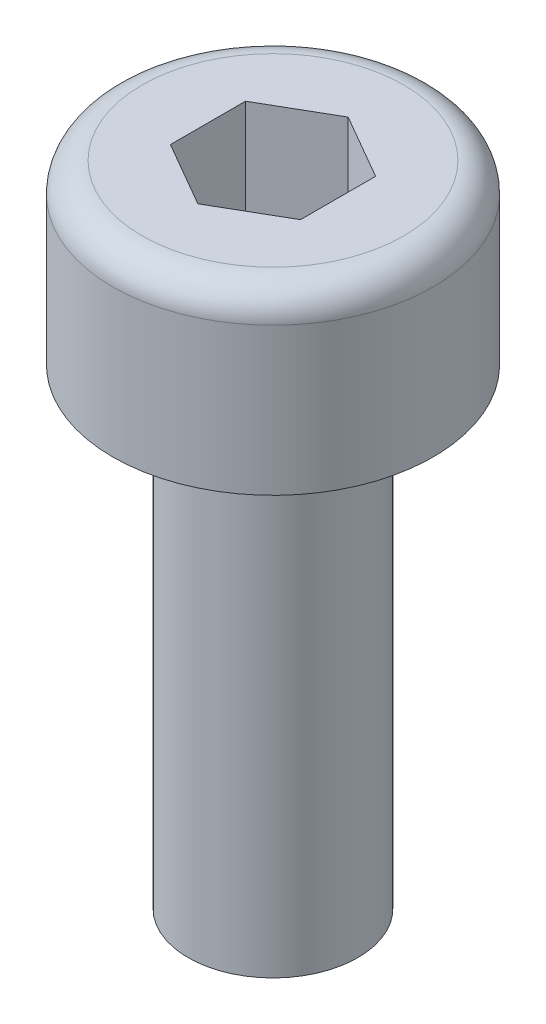
ISO-10303-21;
HEADER;
FILE_DESCRIPTION(('STEP AP214'),'2;1');
FILE_NAME('part.step','',(''),(''),'','','');
FILE_SCHEMA(('AUTOMOTIVE_DESIGN { 1 0 10303 214 1 1 1 1 }'));
ENDSEC;
DATA;
#1=APPLICATION_CONTEXT('core data for automotive mechanical design processes');
#2=APPLICATION_PROTOCOL_DEFINITION('international standard','automotive_design',2000,#1);
#3=PRODUCT_CONTEXT('',#1,'mechanical');
#4=PRODUCT('Part','Part','',(#3));
#5=PRODUCT_RELATED_PRODUCT_CATEGORY('part','',(#4));
#6=PRODUCT_DEFINITION_FORMATION('','',#4);
#7=PRODUCT_DEFINITION_CONTEXT('part definition',#1,'design');
#8=PRODUCT_DEFINITION('design','',#6,#7);
#9=PRODUCT_DEFINITION_SHAPE('','',#8);
#10=(LENGTH_UNIT() NAMED_UNIT(*) SI_UNIT(.MILLI.,.METRE.));
#11=(NAMED_UNIT(*) PLANE_ANGLE_UNIT() SI_UNIT($,.RADIAN.));
#12=(NAMED_UNIT(*) SI_UNIT($,.STERADIAN.) SOLID_ANGLE_UNIT());
#13=UNCERTAINTY_MEASURE_WITH_UNIT(LENGTH_MEASURE(1.E-05),#10,'distance_accuracy_value','');
#14=(GEOMETRIC_REPRESENTATION_CONTEXT(3) GLOBAL_UNCERTAINTY_ASSIGNED_CONTEXT((#13)) GLOBAL_UNIT_ASSIGNED_CONTEXT((#10,
#11,#12)) REPRESENTATION_CONTEXT('',''));
#15=CARTESIAN_POINT('',(0.,0.,0.));
#16=DIRECTION('',(0.,0.,1.));
#17=DIRECTION('',(1.,0.,0.));
#18=AXIS2_PLACEMENT_3D('',#15,#16,#17);
#19=CARTESIAN_POINT('',(0.,3.,0.));
#20=DIRECTION('',(0.,-1.,0.));
#21=DIRECTION('',(0.,0.,-1.));
#22=AXIS2_PLACEMENT_3D('',#19,#20,#21);
#23=CYLINDRICAL_SURFACE('',#22,2.72);
#24=CARTESIAN_POINT('',(0.,2.5,0.));
#25=DIRECTION('',(0.,1.,0.));
#26=DIRECTION('',(0.,0.,1.));
#27=AXIS2_PLACEMENT_3D('',#24,#25,#26);
#28=CIRCLE('',#27,2.72);
#29=CARTESIAN_POINT('',(0.,2.5,2.72));
#30=VERTEX_POINT('',#29);
#31=EDGE_CURVE('E11',#30,#30,#28,.F.);
#32=ORIENTED_EDGE('',*,*,#31,.T.);
#33=EDGE_LOOP('',(#32));
#34=FACE_BOUND('',#33,.T.);
#35=CARTESIAN_POINT('',(0.,0.,0.));
#36=DIRECTION('',(0.,1.,0.));
#37=DIRECTION('',(0.,0.,1.));
#38=AXIS2_PLACEMENT_3D('',#35,#36,#37);
#39=CIRCLE('',#38,2.72);
#40=CARTESIAN_POINT('',(0.,0.,2.72));
#41=VERTEX_POINT('',#40);
#42=EDGE_CURVE('E153',#41,#41,#39,.T.);
#43=ORIENTED_EDGE('',*,*,#42,.T.);
#44=EDGE_LOOP('',(#43));
#45=FACE_BOUND('',#44,.T.);
#46=ADVANCED_FACE('F43',(#34,#45),#23,.T.);
#47=CARTESIAN_POINT('',(0.,3.,0.));
#48=DIRECTION('',(0.,1.,0.));
#49=DIRECTION('',(0.,0.,1.));
#50=AXIS2_PLACEMENT_3D('',#47,#48,#49);
#51=PLANE('',#50);
#52=CARTESIAN_POINT('',(0.,3.,0.));
#53=DIRECTION('',(0.,1.,0.));
#54=DIRECTION('',(0.,0.,1.));
#55=AXIS2_PLACEMENT_3D('',#52,#53,#54);
#56=CIRCLE('',#55,2.22);
#57=CARTESIAN_POINT('',(0.,3.,2.22));
#58=VERTEX_POINT('',#57);
#59=EDGE_CURVE('E51',#58,#58,#56,.T.);
#60=ORIENTED_EDGE('',*,*,#59,.T.);
#61=EDGE_LOOP('',(#60));
#62=FACE_BOUND('',#61,.T.);
#63=DIRECTION('',(0.,0.,-1.));
#64=VECTOR('',#63,1.);
#65=CARTESIAN_POINT('',(1.10418238982516,3.,0.637500000000001));
#66=LINE('',#65,#64);
#67=CARTESIAN_POINT('',(1.10418238982516,3.,0.637500000000001));
#68=VERTEX_POINT('',#67);
#69=CARTESIAN_POINT('',(1.10418238982516,3.,-0.6375));
#70=VERTEX_POINT('',#69);
#71=EDGE_CURVE('E58',#68,#70,#66,.T.);
#72=ORIENTED_EDGE('',*,*,#71,.F.);
#73=DIRECTION('',(0.866025403784439,0.,-0.5));
#74=VECTOR('',#73,1.);
#75=CARTESIAN_POINT('',(0.,3.,1.275));
#76=LINE('',#75,#74);
#77=CARTESIAN_POINT('',(0.,3.,1.275));
#78=VERTEX_POINT('',#77);
#79=EDGE_CURVE('E141',#78,#68,#76,.T.);
#80=ORIENTED_EDGE('',*,*,#79,.F.);
#81=DIRECTION('',(0.866025403784439,0.,0.5));
#82=VECTOR('',#81,1.);
#83=CARTESIAN_POINT('',(-1.10418238982516,3.,0.6375));
#84=LINE('',#83,#82);
#85=CARTESIAN_POINT('',(-1.10418238982516,3.,0.6375));
#86=VERTEX_POINT('',#85);
#87=EDGE_CURVE('E139',#86,#78,#84,.T.);
#88=ORIENTED_EDGE('',*,*,#87,.F.);
#89=DIRECTION('',(0.,0.,1.));
#90=VECTOR('',#89,1.);
#91=CARTESIAN_POINT('',(-1.10418238982516,3.,-0.637500000000001));
#92=LINE('',#91,#90);
#93=CARTESIAN_POINT('',(-1.10418238982516,3.,-0.637500000000001));
#94=VERTEX_POINT('',#93);
#95=EDGE_CURVE('E106',#94,#86,#92,.T.);
#96=ORIENTED_EDGE('',*,*,#95,.F.);
#97=DIRECTION('',(-0.866025403784439,0.,0.5));
#98=VECTOR('',#97,1.);
#99=CARTESIAN_POINT('',(0.,3.,-1.275));
#100=LINE('',#99,#98);
#101=CARTESIAN_POINT('',(0.,3.,-1.275));
#102=VERTEX_POINT('',#101);
#103=EDGE_CURVE('E135',#102,#94,#100,.T.);
#104=ORIENTED_EDGE('',*,*,#103,.F.);
#105=DIRECTION('',(-0.866025403784438,0.,-0.5));
#106=VECTOR('',#105,1.);
#107=CARTESIAN_POINT('',(1.10418238982516,3.,-0.6375));
#108=LINE('',#107,#106);
#109=EDGE_CURVE('E132',#70,#102,#108,.T.);
#110=ORIENTED_EDGE('',*,*,#109,.F.);
#111=EDGE_LOOP('',(#72,#80,#88,#96,#104,#110));
#112=FACE_BOUND('',#111,.T.);
#113=ADVANCED_FACE('F161',(#62,#112),#51,.T.);
#114=CARTESIAN_POINT('',(0.,0.,0.));
#115=DIRECTION('',(0.,1.,0.));
#116=DIRECTION('',(0.,0.,1.));
#117=AXIS2_PLACEMENT_3D('',#114,#115,#116);
#118=PLANE('',#117);
#119=CARTESIAN_POINT('',(0.,0.,0.));
#120=DIRECTION('',(0.,-1.,0.));
#121=DIRECTION('',(0.,0.,-1.));
#122=AXIS2_PLACEMENT_3D('',#119,#120,#121);
#123=CIRCLE('',#122,1.44);
#124=CARTESIAN_POINT('',(0.,0.,-1.44));
#125=VERTEX_POINT('',#124);
#126=EDGE_CURVE('E154',#125,#125,#123,.T.);
#127=ORIENTED_EDGE('',*,*,#126,.F.);
#128=EDGE_LOOP('',(#127));
#129=FACE_BOUND('',#128,.T.);
#130=ORIENTED_EDGE('',*,*,#42,.F.);
#131=EDGE_LOOP('',(#130));
#132=FACE_BOUND('',#131,.T.);
#133=ADVANCED_FACE('F177',(#129,#132),#118,.F.);
#134=CARTESIAN_POINT('',(0.,-8.,0.));
#135=DIRECTION('',(0.,1.,0.));
#136=DIRECTION('',(0.,0.,1.));
#137=AXIS2_PLACEMENT_3D('',#134,#135,#136);
#138=CYLINDRICAL_SURFACE('',#137,1.44);
#139=CARTESIAN_POINT('',(0.,-8.,0.));
#140=DIRECTION('',(0.,-1.,0.));
#141=DIRECTION('',(0.,0.,-1.));
#142=AXIS2_PLACEMENT_3D('',#139,#140,#141);
#143=CIRCLE('',#142,1.44);
#144=CARTESIAN_POINT('',(0.,-8.,-1.44));
#145=VERTEX_POINT('',#144);
#146=EDGE_CURVE('E145',#145,#145,#143,.T.);
#147=ORIENTED_EDGE('',*,*,#146,.F.);
#148=EDGE_LOOP('',(#147));
#149=FACE_BOUND('',#148,.T.);
#150=ORIENTED_EDGE('',*,*,#126,.T.);
#151=EDGE_LOOP('',(#150));
#152=FACE_BOUND('',#151,.T.);
#153=ADVANCED_FACE('F182',(#149,#152),#138,.T.);
#154=CARTESIAN_POINT('',(0.,-8.,0.));
#155=DIRECTION('',(0.,-1.,0.));
#156=DIRECTION('',(0.,0.,-1.));
#157=AXIS2_PLACEMENT_3D('',#154,#155,#156);
#158=PLANE('',#157);
#159=ORIENTED_EDGE('',*,*,#146,.T.);
#160=EDGE_LOOP('',(#159));
#161=FACE_BOUND('',#160,.T.);
#162=ADVANCED_FACE('F187',(#161),#158,.T.);
#163=CARTESIAN_POINT('',(1.10418238982516,1.05,0.637500000000001));
#164=DIRECTION('',(1.,0.,0.));
#165=DIRECTION('',(0.,0.,-1.));
#166=AXIS2_PLACEMENT_3D('',#163,#164,#165);
#167=PLANE('',#166);
#168=ORIENTED_EDGE('',*,*,#71,.T.);
#169=DIRECTION('',(0.,1.,0.));
#170=VECTOR('',#169,1.);
#171=CARTESIAN_POINT('',(1.10418238982516,1.05,-0.6375));
#172=LINE('',#171,#170);
#173=CARTESIAN_POINT('',(1.10418238982516,1.05,-0.6375));
#174=VERTEX_POINT('',#173);
#175=EDGE_CURVE('E88',#174,#70,#172,.T.);
#176=ORIENTED_EDGE('',*,*,#175,.F.);
#177=DIRECTION('',(0.,0.,-1.));
#178=VECTOR('',#177,1.);
#179=CARTESIAN_POINT('',(1.10418238982516,1.05,0.637500000000001));
#180=LINE('',#179,#178);
#181=CARTESIAN_POINT('',(1.10418238982516,1.05,0.637500000000001));
#182=VERTEX_POINT('',#181);
#183=EDGE_CURVE('E143',#182,#174,#180,.T.);
#184=ORIENTED_EDGE('',*,*,#183,.F.);
#185=DIRECTION('',(0.,1.,0.));
#186=VECTOR('',#185,1.);
#187=CARTESIAN_POINT('',(1.10418238982516,1.05,0.637500000000001));
#188=LINE('',#187,#186);
#189=EDGE_CURVE('E66',#182,#68,#188,.T.);
#190=ORIENTED_EDGE('',*,*,#189,.T.);
#191=EDGE_LOOP('',(#168,#176,#184,#190));
#192=FACE_BOUND('',#191,.T.);
#193=ADVANCED_FACE('F191',(#192),#167,.F.);
#194=CARTESIAN_POINT('',(0.,1.05,1.275));
#195=DIRECTION('',(0.5,0.,0.866025403784439));
#196=DIRECTION('',(0.866025403784439,0.,-0.5));
#197=AXIS2_PLACEMENT_3D('',#194,#195,#196);
#198=PLANE('',#197);
#199=ORIENTED_EDGE('',*,*,#79,.T.);
#200=ORIENTED_EDGE('',*,*,#189,.F.);
#201=DIRECTION('',(0.866025403784439,0.,-0.5));
#202=VECTOR('',#201,1.);
#203=CARTESIAN_POINT('',(0.,1.05,1.275));
#204=LINE('',#203,#202);
#205=CARTESIAN_POINT('',(0.,1.05,1.275));
#206=VERTEX_POINT('',#205);
#207=EDGE_CURVE('E118',#206,#182,#204,.T.);
#208=ORIENTED_EDGE('',*,*,#207,.F.);
#209=DIRECTION('',(0.,1.,0.));
#210=VECTOR('',#209,1.);
#211=CARTESIAN_POINT('',(0.,1.05,1.275));
#212=LINE('',#211,#210);
#213=EDGE_CURVE('E110',#206,#78,#212,.T.);
#214=ORIENTED_EDGE('',*,*,#213,.T.);
#215=EDGE_LOOP('',(#199,#200,#208,#214));
#216=FACE_BOUND('',#215,.T.);
#217=ADVANCED_FACE('F195',(#216),#198,.F.);
#218=CARTESIAN_POINT('',(-1.10418238982516,1.05,0.6375));
#219=DIRECTION('',(-0.5,0.,0.866025403784438));
#220=DIRECTION('',(0.866025403784439,0.,0.5));
#221=AXIS2_PLACEMENT_3D('',#218,#219,#220);
#222=PLANE('',#221);
#223=ORIENTED_EDGE('',*,*,#87,.T.);
#224=ORIENTED_EDGE('',*,*,#213,.F.);
#225=DIRECTION('',(0.866025403784439,0.,0.5));
#226=VECTOR('',#225,1.);
#227=CARTESIAN_POINT('',(-1.10418238982516,1.05,0.6375));
#228=LINE('',#227,#226);
#229=CARTESIAN_POINT('',(-1.10418238982516,1.05,0.6375));
#230=VERTEX_POINT('',#229);
#231=EDGE_CURVE('E114',#230,#206,#228,.T.);
#232=ORIENTED_EDGE('',*,*,#231,.F.);
#233=DIRECTION('',(0.,1.,0.));
#234=VECTOR('',#233,1.);
#235=CARTESIAN_POINT('',(-1.10418238982516,1.05,0.6375));
#236=LINE('',#235,#234);
#237=EDGE_CURVE('E99',#230,#86,#236,.T.);
#238=ORIENTED_EDGE('',*,*,#237,.T.);
#239=EDGE_LOOP('',(#223,#224,#232,#238));
#240=FACE_BOUND('',#239,.T.);
#241=ADVANCED_FACE('F115',(#240),#222,.F.);
#242=CARTESIAN_POINT('',(-1.10418238982516,1.05,-0.637500000000001));
#243=DIRECTION('',(-1.,0.,0.));
#244=DIRECTION('',(0.,0.,1.));
#245=AXIS2_PLACEMENT_3D('',#242,#243,#244);
#246=PLANE('',#245);
#247=ORIENTED_EDGE('',*,*,#95,.T.);
#248=ORIENTED_EDGE('',*,*,#237,.F.);
#249=DIRECTION('',(0.,0.,1.));
#250=VECTOR('',#249,1.);
#251=CARTESIAN_POINT('',(-1.10418238982516,1.05,-0.637500000000001));
#252=LINE('',#251,#250);
#253=CARTESIAN_POINT('',(-1.10418238982516,1.05,-0.637500000000001));
#254=VERTEX_POINT('',#253);
#255=EDGE_CURVE('E103',#254,#230,#252,.T.);
#256=ORIENTED_EDGE('',*,*,#255,.F.);
#257=DIRECTION('',(0.,1.,0.));
#258=VECTOR('',#257,1.);
#259=CARTESIAN_POINT('',(-1.10418238982516,1.05,-0.637500000000001));
#260=LINE('',#259,#258);
#261=EDGE_CURVE('E111',#254,#94,#260,.T.);
#262=ORIENTED_EDGE('',*,*,#261,.T.);
#263=EDGE_LOOP('',(#247,#248,#256,#262));
#264=FACE_BOUND('',#263,.T.);
#265=ADVANCED_FACE('F101',(#264),#246,.F.);
#266=CARTESIAN_POINT('',(0.,1.05,-1.275));
#267=DIRECTION('',(-0.5,0.,-0.866025403784439));
#268=DIRECTION('',(-0.866025403784439,0.,0.5));
#269=AXIS2_PLACEMENT_3D('',#266,#267,#268);
#270=PLANE('',#269);
#271=ORIENTED_EDGE('',*,*,#103,.T.);
#272=ORIENTED_EDGE('',*,*,#261,.F.);
#273=DIRECTION('',(-0.866025403784439,0.,0.5));
#274=VECTOR('',#273,1.);
#275=CARTESIAN_POINT('',(0.,1.05,-1.275));
#276=LINE('',#275,#274);
#277=CARTESIAN_POINT('',(0.,1.05,-1.275));
#278=VERTEX_POINT('',#277);
#279=EDGE_CURVE('E124',#278,#254,#276,.T.);
#280=ORIENTED_EDGE('',*,*,#279,.F.);
#281=DIRECTION('',(0.,1.,0.));
#282=VECTOR('',#281,1.);
#283=CARTESIAN_POINT('',(0.,1.05,-1.275));
#284=LINE('',#283,#282);
#285=EDGE_CURVE('E148',#278,#102,#284,.T.);
#286=ORIENTED_EDGE('',*,*,#285,.T.);
#287=EDGE_LOOP('',(#271,#272,#280,#286));
#288=FACE_BOUND('',#287,.T.);
#289=ADVANCED_FACE('F198',(#288),#270,.F.);
#290=CARTESIAN_POINT('',(1.10418238982516,1.05,-0.6375));
#291=DIRECTION('',(0.5,0.,-0.866025403784439));
#292=DIRECTION('',(-0.866025403784439,0.,-0.5));
#293=AXIS2_PLACEMENT_3D('',#290,#291,#292);
#294=PLANE('',#293);
#295=ORIENTED_EDGE('',*,*,#109,.T.);
#296=ORIENTED_EDGE('',*,*,#285,.F.);
#297=DIRECTION('',(-0.866025403784438,0.,-0.5));
#298=VECTOR('',#297,1.);
#299=CARTESIAN_POINT('',(1.10418238982516,1.05,-0.6375));
#300=LINE('',#299,#298);
#301=EDGE_CURVE('E126',#174,#278,#300,.T.);
#302=ORIENTED_EDGE('',*,*,#301,.F.);
#303=ORIENTED_EDGE('',*,*,#175,.T.);
#304=EDGE_LOOP('',(#295,#296,#302,#303));
#305=FACE_BOUND('',#304,.T.);
#306=ADVANCED_FACE('F169',(#305),#294,.F.);
#307=CARTESIAN_POINT('',(0.,1.05,0.));
#308=DIRECTION('',(0.,1.,0.));
#309=DIRECTION('',(0.,0.,1.));
#310=AXIS2_PLACEMENT_3D('',#307,#308,#309);
#311=PLANE('',#310);
#312=ORIENTED_EDGE('',*,*,#183,.T.);
#313=ORIENTED_EDGE('',*,*,#301,.T.);
#314=ORIENTED_EDGE('',*,*,#279,.T.);
#315=ORIENTED_EDGE('',*,*,#255,.T.);
#316=ORIENTED_EDGE('',*,*,#231,.T.);
#317=ORIENTED_EDGE('',*,*,#207,.T.);
#318=EDGE_LOOP('',(#312,#313,#314,#315,#316,#317));
#319=FACE_BOUND('',#318,.T.);
#320=ADVANCED_FACE('F121',(#319),#311,.T.);
#321=CARTESIAN_POINT('',(0.,2.5,0.));
#322=DIRECTION('',(0.,1.,0.));
#323=DIRECTION('',(0.,0.,1.));
#324=AXIS2_PLACEMENT_3D('',#321,#322,#323);
#325=TOROIDAL_SURFACE('',#324,2.22,0.5);
#326=ORIENTED_EDGE('',*,*,#31,.F.);
#327=EDGE_LOOP('',(#326));
#328=FACE_BOUND('',#327,.T.);
#329=ORIENTED_EDGE('',*,*,#59,.F.);
#330=EDGE_LOOP('',(#329));
#331=FACE_BOUND('',#330,.T.);
#332=ADVANCED_FACE('F45',(#328,#331),#325,.T.);
#333=CLOSED_SHELL('',(#46,#113,#133,#153,#162,#193,#217,#241,#265,#289,#306,#320,#332));
#334=MANIFOLD_SOLID_BREP('B2',#333);
#335=ADVANCED_BREP_SHAPE_REPRESENTATION('',(#18,#334),#14);
#336=SHAPE_DEFINITION_REPRESENTATION(#9,#335);
ENDSEC;
END-ISO-10303-21;
